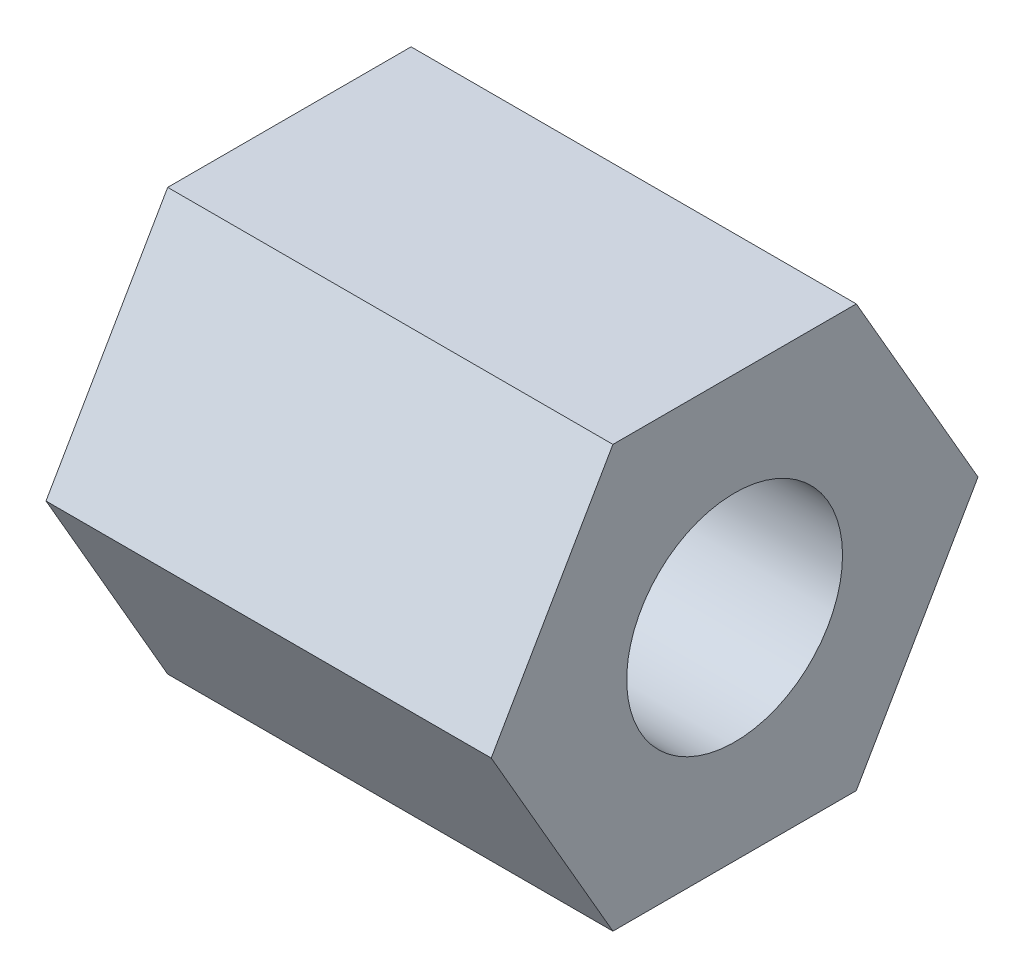
ISO-10303-21;
HEADER;
FILE_DESCRIPTION(('STEP AP214'),'2;1');
FILE_NAME('part.step','',(''),(''),'','','');
FILE_SCHEMA(('AUTOMOTIVE_DESIGN { 1 0 10303 214 1 1 1 1 }'));
ENDSEC;
DATA;
#1=APPLICATION_CONTEXT('core data for automotive mechanical design processes');
#2=APPLICATION_PROTOCOL_DEFINITION('international standard','automotive_design',2000,#1);
#3=PRODUCT_CONTEXT('',#1,'mechanical');
#4=PRODUCT('Part','Part','',(#3));
#5=PRODUCT_RELATED_PRODUCT_CATEGORY('part','',(#4));
#6=PRODUCT_DEFINITION_FORMATION('','',#4);
#7=PRODUCT_DEFINITION_CONTEXT('part definition',#1,'design');
#8=PRODUCT_DEFINITION('design','',#6,#7);
#9=PRODUCT_DEFINITION_SHAPE('','',#8);
#10=(LENGTH_UNIT() NAMED_UNIT(*) SI_UNIT(.MILLI.,.METRE.));
#11=(NAMED_UNIT(*) PLANE_ANGLE_UNIT() SI_UNIT($,.RADIAN.));
#12=(NAMED_UNIT(*) SI_UNIT($,.STERADIAN.) SOLID_ANGLE_UNIT());
#13=UNCERTAINTY_MEASURE_WITH_UNIT(LENGTH_MEASURE(1.E-05),#10,'distance_accuracy_value','');
#14=(GEOMETRIC_REPRESENTATION_CONTEXT(3) GLOBAL_UNCERTAINTY_ASSIGNED_CONTEXT((#13)) GLOBAL_UNIT_ASSIGNED_CONTEXT((#10,
#11,#12)) REPRESENTATION_CONTEXT('',''));
#15=CARTESIAN_POINT('',(0.,0.,0.));
#16=DIRECTION('',(0.,0.,1.));
#17=DIRECTION('',(1.,0.,0.));
#18=AXIS2_PLACEMENT_3D('',#15,#16,#17);
#19=CARTESIAN_POINT('',(5.03,-2.38125,-1.3748153285078));
#20=DIRECTION('',(0.,0.5,0.866025403784439));
#21=DIRECTION('',(0.,-0.866025403784439,0.5));
#22=AXIS2_PLACEMENT_3D('',#19,#20,#21);
#23=PLANE('',#22);
#24=DIRECTION('',(0.,0.866025403784439,-0.5));
#25=VECTOR('',#24,1.);
#26=CARTESIAN_POINT('',(0.,-2.38125,-1.3748153285078));
#27=LINE('',#26,#25);
#28=CARTESIAN_POINT('',(0.,-2.38125,-1.3748153285078));
#29=VERTEX_POINT('',#28);
#30=CARTESIAN_POINT('',(0.,0.,-2.74963065701559));
#31=VERTEX_POINT('',#30);
#32=EDGE_CURVE('E124',#29,#31,#27,.T.);
#33=ORIENTED_EDGE('',*,*,#32,.T.);
#34=DIRECTION('',(-1.,0.,0.));
#35=VECTOR('',#34,1.);
#36=CARTESIAN_POINT('',(5.03,0.,-2.74963065701559));
#37=LINE('',#36,#35);
#38=CARTESIAN_POINT('',(5.03,0.,-2.74963065701559));
#39=VERTEX_POINT('',#38);
#40=EDGE_CURVE('E11',#39,#31,#37,.T.);
#41=ORIENTED_EDGE('',*,*,#40,.F.);
#42=DIRECTION('',(0.,0.866025403784439,-0.5));
#43=VECTOR('',#42,1.);
#44=CARTESIAN_POINT('',(5.03,-2.38125,-1.3748153285078));
#45=LINE('',#44,#43);
#46=CARTESIAN_POINT('',(5.03,-2.38125,-1.3748153285078));
#47=VERTEX_POINT('',#46);
#48=EDGE_CURVE('E135',#47,#39,#45,.T.);
#49=ORIENTED_EDGE('',*,*,#48,.F.);
#50=DIRECTION('',(-1.,0.,0.));
#51=VECTOR('',#50,1.);
#52=CARTESIAN_POINT('',(5.03,-2.38125,-1.3748153285078));
#53=LINE('',#52,#51);
#54=EDGE_CURVE('E120',#47,#29,#53,.T.);
#55=ORIENTED_EDGE('',*,*,#54,.T.);
#56=EDGE_LOOP('',(#33,#41,#49,#55));
#57=FACE_BOUND('',#56,.T.);
#58=ADVANCED_FACE('F40',(#57),#23,.F.);
#59=CARTESIAN_POINT('',(5.03,0.,-2.74963065701559));
#60=DIRECTION('',(0.,-0.5,0.866025403784439));
#61=DIRECTION('',(0.,-0.866025403784439,-0.5));
#62=AXIS2_PLACEMENT_3D('',#59,#60,#61);
#63=PLANE('',#62);
#64=DIRECTION('',(0.,0.866025403784439,0.5));
#65=VECTOR('',#64,1.);
#66=CARTESIAN_POINT('',(0.,0.,-2.74963065701559));
#67=LINE('',#66,#65);
#68=CARTESIAN_POINT('',(0.,2.38125,-1.3748153285078));
#69=VERTEX_POINT('',#68);
#70=EDGE_CURVE('E127',#31,#69,#67,.T.);
#71=ORIENTED_EDGE('',*,*,#70,.T.);
#72=DIRECTION('',(-1.,0.,0.));
#73=VECTOR('',#72,1.);
#74=CARTESIAN_POINT('',(5.03,2.38125,-1.3748153285078));
#75=LINE('',#74,#73);
#76=CARTESIAN_POINT('',(5.03,2.38125,-1.3748153285078));
#77=VERTEX_POINT('',#76);
#78=EDGE_CURVE('E48',#77,#69,#75,.T.);
#79=ORIENTED_EDGE('',*,*,#78,.F.);
#80=DIRECTION('',(0.,0.866025403784439,0.5));
#81=VECTOR('',#80,1.);
#82=CARTESIAN_POINT('',(5.03,0.,-2.74963065701559));
#83=LINE('',#82,#81);
#84=EDGE_CURVE('E93',#39,#77,#83,.T.);
#85=ORIENTED_EDGE('',*,*,#84,.F.);
#86=ORIENTED_EDGE('',*,*,#40,.T.);
#87=EDGE_LOOP('',(#71,#79,#85,#86));
#88=FACE_BOUND('',#87,.T.);
#89=ADVANCED_FACE('F160',(#88),#63,.F.);
#90=CARTESIAN_POINT('',(5.03,2.38125,-1.3748153285078));
#91=DIRECTION('',(0.,-1.,0.));
#92=DIRECTION('',(0.,0.,-1.));
#93=AXIS2_PLACEMENT_3D('',#90,#91,#92);
#94=PLANE('',#93);
#95=DIRECTION('',(0.,0.,1.));
#96=VECTOR('',#95,1.);
#97=CARTESIAN_POINT('',(0.,2.38125,-1.3748153285078));
#98=LINE('',#97,#96);
#99=CARTESIAN_POINT('',(0.,2.38125,1.3748153285078));
#100=VERTEX_POINT('',#99);
#101=EDGE_CURVE('E130',#69,#100,#98,.T.);
#102=ORIENTED_EDGE('',*,*,#101,.T.);
#103=DIRECTION('',(-1.,0.,0.));
#104=VECTOR('',#103,1.);
#105=CARTESIAN_POINT('',(5.03,2.38125,1.3748153285078));
#106=LINE('',#105,#104);
#107=CARTESIAN_POINT('',(5.03,2.38125,1.3748153285078));
#108=VERTEX_POINT('',#107);
#109=EDGE_CURVE('E115',#108,#100,#106,.T.);
#110=ORIENTED_EDGE('',*,*,#109,.F.);
#111=DIRECTION('',(0.,0.,1.));
#112=VECTOR('',#111,1.);
#113=CARTESIAN_POINT('',(5.03,2.38125,-1.3748153285078));
#114=LINE('',#113,#112);
#115=EDGE_CURVE('E106',#77,#108,#114,.T.);
#116=ORIENTED_EDGE('',*,*,#115,.F.);
#117=ORIENTED_EDGE('',*,*,#78,.T.);
#118=EDGE_LOOP('',(#102,#110,#116,#117));
#119=FACE_BOUND('',#118,.T.);
#120=ADVANCED_FACE('F141',(#119),#94,.F.);
#121=CARTESIAN_POINT('',(5.03,2.38125,1.3748153285078));
#122=DIRECTION('',(0.,-0.5,-0.866025403784439));
#123=DIRECTION('',(0.,0.866025403784439,-0.5));
#124=AXIS2_PLACEMENT_3D('',#121,#122,#123);
#125=PLANE('',#124);
#126=DIRECTION('',(0.,-0.866025403784439,0.5));
#127=VECTOR('',#126,1.);
#128=CARTESIAN_POINT('',(0.,2.38125,1.3748153285078));
#129=LINE('',#128,#127);
#130=CARTESIAN_POINT('',(0.,0.,2.74963065701559));
#131=VERTEX_POINT('',#130);
#132=EDGE_CURVE('E114',#100,#131,#129,.T.);
#133=ORIENTED_EDGE('',*,*,#132,.T.);
#134=DIRECTION('',(-1.,0.,0.));
#135=VECTOR('',#134,1.);
#136=CARTESIAN_POINT('',(5.03,0.,2.74963065701559));
#137=LINE('',#136,#135);
#138=CARTESIAN_POINT('',(5.03,0.,2.74963065701559));
#139=VERTEX_POINT('',#138);
#140=EDGE_CURVE('E111',#139,#131,#137,.T.);
#141=ORIENTED_EDGE('',*,*,#140,.F.);
#142=DIRECTION('',(0.,-0.866025403784439,0.5));
#143=VECTOR('',#142,1.);
#144=CARTESIAN_POINT('',(5.03,2.38125,1.3748153285078));
#145=LINE('',#144,#143);
#146=EDGE_CURVE('E100',#108,#139,#145,.T.);
#147=ORIENTED_EDGE('',*,*,#146,.F.);
#148=ORIENTED_EDGE('',*,*,#109,.T.);
#149=EDGE_LOOP('',(#133,#141,#147,#148));
#150=FACE_BOUND('',#149,.T.);
#151=ADVANCED_FACE('F112',(#150),#125,.F.);
#152=CARTESIAN_POINT('',(5.03,0.,2.74963065701559));
#153=DIRECTION('',(0.,0.5,-0.866025403784439));
#154=DIRECTION('',(0.,0.866025403784439,0.5));
#155=AXIS2_PLACEMENT_3D('',#152,#153,#154);
#156=PLANE('',#155);
#157=DIRECTION('',(0.,-0.866025403784439,-0.5));
#158=VECTOR('',#157,1.);
#159=CARTESIAN_POINT('',(0.,0.,2.74963065701559));
#160=LINE('',#159,#158);
#161=CARTESIAN_POINT('',(0.,-2.38125,1.3748153285078));
#162=VERTEX_POINT('',#161);
#163=EDGE_CURVE('E79',#131,#162,#160,.T.);
#164=ORIENTED_EDGE('',*,*,#163,.T.);
#165=DIRECTION('',(-1.,0.,0.));
#166=VECTOR('',#165,1.);
#167=CARTESIAN_POINT('',(5.03,-2.38125,1.3748153285078));
#168=LINE('',#167,#166);
#169=CARTESIAN_POINT('',(5.03,-2.38125,1.3748153285078));
#170=VERTEX_POINT('',#169);
#171=EDGE_CURVE('E116',#170,#162,#168,.T.);
#172=ORIENTED_EDGE('',*,*,#171,.F.);
#173=DIRECTION('',(0.,-0.866025403784439,-0.5));
#174=VECTOR('',#173,1.);
#175=CARTESIAN_POINT('',(5.03,0.,2.74963065701559));
#176=LINE('',#175,#174);
#177=EDGE_CURVE('E104',#139,#170,#176,.T.);
#178=ORIENTED_EDGE('',*,*,#177,.F.);
#179=ORIENTED_EDGE('',*,*,#140,.T.);
#180=EDGE_LOOP('',(#164,#172,#178,#179));
#181=FACE_BOUND('',#180,.T.);
#182=ADVANCED_FACE('F118',(#181),#156,.F.);
#183=CARTESIAN_POINT('',(5.03,-2.38125,1.3748153285078));
#184=DIRECTION('',(0.,1.,0.));
#185=DIRECTION('',(0.,0.,1.));
#186=AXIS2_PLACEMENT_3D('',#183,#184,#185);
#187=PLANE('',#186);
#188=DIRECTION('',(0.,0.,-1.));
#189=VECTOR('',#188,1.);
#190=CARTESIAN_POINT('',(0.,-2.38125,1.3748153285078));
#191=LINE('',#190,#189);
#192=EDGE_CURVE('E85',#162,#29,#191,.T.);
#193=ORIENTED_EDGE('',*,*,#192,.T.);
#194=ORIENTED_EDGE('',*,*,#54,.F.);
#195=DIRECTION('',(0.,0.,-1.));
#196=VECTOR('',#195,1.);
#197=CARTESIAN_POINT('',(5.03,-2.38125,1.3748153285078));
#198=LINE('',#197,#196);
#199=EDGE_CURVE('E56',#170,#47,#198,.T.);
#200=ORIENTED_EDGE('',*,*,#199,.F.);
#201=ORIENTED_EDGE('',*,*,#171,.T.);
#202=EDGE_LOOP('',(#193,#194,#200,#201));
#203=FACE_BOUND('',#202,.T.);
#204=ADVANCED_FACE('F148',(#203),#187,.F.);
#205=CARTESIAN_POINT('',(5.03,0.,0.));
#206=DIRECTION('',(1.,0.,0.));
#207=DIRECTION('',(0.,0.,-1.));
#208=AXIS2_PLACEMENT_3D('',#205,#206,#207);
#209=PLANE('',#208);
#210=CARTESIAN_POINT('',(5.03,0.,0.));
#211=DIRECTION('',(1.,0.,0.));
#212=DIRECTION('',(0.,0.,-1.));
#213=AXIS2_PLACEMENT_3D('',#210,#211,#212);
#214=CIRCLE('',#213,1.21919999999999);
#215=CARTESIAN_POINT('',(5.03,0.,-1.21919999999999));
#216=VERTEX_POINT('',#215);
#217=EDGE_CURVE('E215',#216,#216,#214,.T.);
#218=ORIENTED_EDGE('',*,*,#217,.F.);
#219=EDGE_LOOP('',(#218));
#220=FACE_BOUND('',#219,.T.);
#221=ORIENTED_EDGE('',*,*,#48,.T.);
#222=ORIENTED_EDGE('',*,*,#84,.T.);
#223=ORIENTED_EDGE('',*,*,#115,.T.);
#224=ORIENTED_EDGE('',*,*,#146,.T.);
#225=ORIENTED_EDGE('',*,*,#177,.T.);
#226=ORIENTED_EDGE('',*,*,#199,.T.);
#227=EDGE_LOOP('',(#221,#222,#223,#224,#225,#226));
#228=FACE_BOUND('',#227,.T.);
#229=ADVANCED_FACE('F102',(#220,#228),#209,.T.);
#230=CARTESIAN_POINT('',(0.,0.,0.));
#231=DIRECTION('',(1.,0.,0.));
#232=DIRECTION('',(0.,0.,-1.));
#233=AXIS2_PLACEMENT_3D('',#230,#231,#232);
#234=PLANE('',#233);
#235=CARTESIAN_POINT('',(0.,0.,0.));
#236=DIRECTION('',(1.,0.,0.));
#237=DIRECTION('',(0.,0.,-1.));
#238=AXIS2_PLACEMENT_3D('',#235,#236,#237);
#239=CIRCLE('',#238,1.2192);
#240=CARTESIAN_POINT('',(0.,0.,-1.2192));
#241=VERTEX_POINT('',#240);
#242=EDGE_CURVE('E128',#241,#241,#239,.T.);
#243=ORIENTED_EDGE('',*,*,#242,.T.);
#244=EDGE_LOOP('',(#243));
#245=FACE_BOUND('',#244,.T.);
#246=ORIENTED_EDGE('',*,*,#32,.F.);
#247=ORIENTED_EDGE('',*,*,#192,.F.);
#248=ORIENTED_EDGE('',*,*,#163,.F.);
#249=ORIENTED_EDGE('',*,*,#132,.F.);
#250=ORIENTED_EDGE('',*,*,#101,.F.);
#251=ORIENTED_EDGE('',*,*,#70,.F.);
#252=EDGE_LOOP('',(#246,#247,#248,#249,#250,#251));
#253=FACE_BOUND('',#252,.T.);
#254=ADVANCED_FACE('F144',(#245,#253),#234,.F.);
#255=CARTESIAN_POINT('',(5.03,0.,0.));
#256=DIRECTION('',(1.,0.,0.));
#257=DIRECTION('',(0.,0.,-1.));
#258=AXIS2_PLACEMENT_3D('',#255,#256,#257);
#259=CYLINDRICAL_SURFACE('',#258,1.21919999999999);
#260=ORIENTED_EDGE('',*,*,#242,.F.);
#261=EDGE_LOOP('',(#260));
#262=FACE_BOUND('',#261,.T.);
#263=ORIENTED_EDGE('',*,*,#217,.T.);
#264=EDGE_LOOP('',(#263));
#265=FACE_BOUND('',#264,.T.);
#266=ADVANCED_FACE('F197',(#262,#265),#259,.F.);
#267=CLOSED_SHELL('',(#58,#89,#120,#151,#182,#204,#229,#254,#266));
#268=MANIFOLD_SOLID_BREP('B2',#267);
#269=ADVANCED_BREP_SHAPE_REPRESENTATION('',(#18,#268),#14);
#270=SHAPE_DEFINITION_REPRESENTATION(#9,#269);
ENDSEC;
END-ISO-10303-21;
